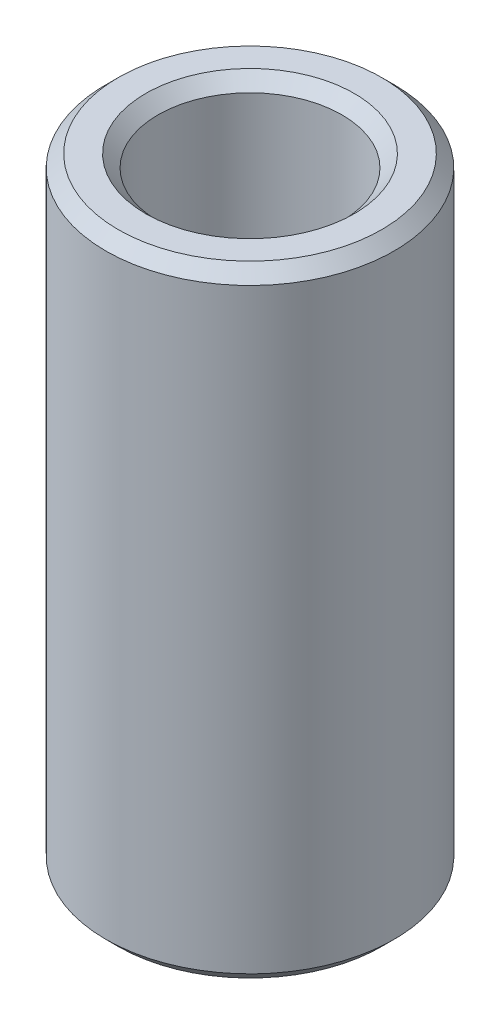
ISO-10303-21;
HEADER;
FILE_DESCRIPTION(('STEP AP214'),'2;1');
FILE_NAME('part.step','',(''),(''),'','','');
FILE_SCHEMA(('AUTOMOTIVE_DESIGN { 1 0 10303 214 1 1 1 1 }'));
ENDSEC;
DATA;
#1=APPLICATION_CONTEXT('core data for automotive mechanical design processes');
#2=APPLICATION_PROTOCOL_DEFINITION('international standard','automotive_design',2000,#1);
#3=PRODUCT_CONTEXT('',#1,'mechanical');
#4=PRODUCT('Part','Part','',(#3));
#5=PRODUCT_RELATED_PRODUCT_CATEGORY('part','',(#4));
#6=PRODUCT_DEFINITION_FORMATION('','',#4);
#7=PRODUCT_DEFINITION_CONTEXT('part definition',#1,'design');
#8=PRODUCT_DEFINITION('design','',#6,#7);
#9=PRODUCT_DEFINITION_SHAPE('','',#8);
#10=(LENGTH_UNIT() NAMED_UNIT(*) SI_UNIT(.MILLI.,.METRE.));
#11=(NAMED_UNIT(*) PLANE_ANGLE_UNIT() SI_UNIT($,.RADIAN.));
#12=(NAMED_UNIT(*) SI_UNIT($,.STERADIAN.) SOLID_ANGLE_UNIT());
#13=UNCERTAINTY_MEASURE_WITH_UNIT(LENGTH_MEASURE(1.E-05),#10,'distance_accuracy_value','');
#14=(GEOMETRIC_REPRESENTATION_CONTEXT(3) GLOBAL_UNCERTAINTY_ASSIGNED_CONTEXT((#13)) GLOBAL_UNIT_ASSIGNED_CONTEXT((#10,
#11,#12)) REPRESENTATION_CONTEXT('',''));
#15=CARTESIAN_POINT('',(0.,0.,0.));
#16=DIRECTION('',(0.,0.,1.));
#17=DIRECTION('',(1.,0.,0.));
#18=AXIS2_PLACEMENT_3D('',#15,#16,#17);
#19=CARTESIAN_POINT('',(0.,129.245161771024,0.));
#20=DIRECTION('',(0.,-1.,0.));
#21=DIRECTION('',(0.,0.,-1.));
#22=AXIS2_PLACEMENT_3D('',#19,#20,#21);
#23=CYLINDRICAL_SURFACE('',#22,30.);
#24=CARTESIAN_POINT('',(0.,2.56942213493205,0.));
#25=DIRECTION('',(0.,1.,0.));
#26=DIRECTION('',(0.,0.,1.));
#27=AXIS2_PLACEMENT_3D('',#24,#25,#26);
#28=CIRCLE('',#27,30.);
#29=CARTESIAN_POINT('',(0.,2.56942213493205,30.));
#30=VERTEX_POINT('',#29);
#31=EDGE_CURVE('E10',#30,#30,#28,.T.);
#32=ORIENTED_EDGE('',*,*,#31,.T.);
#33=EDGE_LOOP('',(#32));
#34=FACE_BOUND('',#33,.T.);
#35=CARTESIAN_POINT('',(0.,126.675739636092,0.));
#36=DIRECTION('',(0.,1.,0.));
#37=DIRECTION('',(0.,0.,1.));
#38=AXIS2_PLACEMENT_3D('',#35,#36,#37);
#39=CIRCLE('',#38,30.);
#40=CARTESIAN_POINT('',(0.,126.675739636092,30.));
#41=VERTEX_POINT('',#40);
#42=EDGE_CURVE('E50',#41,#41,#39,.F.);
#43=ORIENTED_EDGE('',*,*,#42,.T.);
#44=EDGE_LOOP('',(#43));
#45=FACE_BOUND('',#44,.T.);
#46=ADVANCED_FACE('F39',(#34,#45),#23,.T.);
#47=CARTESIAN_POINT('',(0.,129.245161771024,0.));
#48=DIRECTION('',(0.,1.,0.));
#49=DIRECTION('',(0.,0.,1.));
#50=AXIS2_PLACEMENT_3D('',#47,#48,#49);
#51=PLANE('',#50);
#52=CARTESIAN_POINT('',(0.,129.245161771024,0.));
#53=DIRECTION('',(0.,1.,0.));
#54=DIRECTION('',(0.,0.,1.));
#55=AXIS2_PLACEMENT_3D('',#52,#53,#54);
#56=CIRCLE('',#55,21.7052561448556);
#57=CARTESIAN_POINT('',(0.,129.245161771024,21.7052561448556));
#58=VERTEX_POINT('',#57);
#59=EDGE_CURVE('E58',#58,#58,#56,.F.);
#60=ORIENTED_EDGE('',*,*,#59,.T.);
#61=EDGE_LOOP('',(#60));
#62=FACE_BOUND('',#61,.T.);
#63=CARTESIAN_POINT('',(0.,129.245161771024,0.));
#64=DIRECTION('',(0.,1.,0.));
#65=DIRECTION('',(0.,0.,1.));
#66=AXIS2_PLACEMENT_3D('',#63,#64,#65);
#67=CIRCLE('',#66,27.430577865068);
#68=CARTESIAN_POINT('',(0.,129.245161771024,27.430577865068));
#69=VERTEX_POINT('',#68);
#70=EDGE_CURVE('E61',#69,#69,#67,.T.);
#71=ORIENTED_EDGE('',*,*,#70,.T.);
#72=EDGE_LOOP('',(#71));
#73=FACE_BOUND('',#72,.T.);
#74=ADVANCED_FACE('F88',(#62,#73),#51,.T.);
#75=CARTESIAN_POINT('',(0.,0.,0.));
#76=DIRECTION('',(0.,1.,0.));
#77=DIRECTION('',(0.,0.,1.));
#78=AXIS2_PLACEMENT_3D('',#75,#76,#77);
#79=PLANE('',#78);
#80=CARTESIAN_POINT('',(0.,0.,0.));
#81=DIRECTION('',(0.,1.,0.));
#82=DIRECTION('',(0.,0.,1.));
#83=AXIS2_PLACEMENT_3D('',#80,#81,#82);
#84=CIRCLE('',#83,21.7052561448556);
#85=CARTESIAN_POINT('',(0.,0.,21.7052561448556));
#86=VERTEX_POINT('',#85);
#87=EDGE_CURVE('E51',#86,#86,#84,.T.);
#88=ORIENTED_EDGE('',*,*,#87,.T.);
#89=EDGE_LOOP('',(#88));
#90=FACE_BOUND('',#89,.T.);
#91=CARTESIAN_POINT('',(0.,0.,0.));
#92=DIRECTION('',(0.,1.,0.));
#93=DIRECTION('',(0.,0.,1.));
#94=AXIS2_PLACEMENT_3D('',#91,#92,#93);
#95=CIRCLE('',#94,27.4305778650679);
#96=CARTESIAN_POINT('',(0.,0.,27.4305778650679));
#97=VERTEX_POINT('',#96);
#98=EDGE_CURVE('E54',#97,#97,#95,.F.);
#99=ORIENTED_EDGE('',*,*,#98,.T.);
#100=EDGE_LOOP('',(#99));
#101=FACE_BOUND('',#100,.T.);
#102=ADVANCED_FACE('F83',(#90,#101),#79,.F.);
#103=CARTESIAN_POINT('',(0.,129.245161771024,0.));
#104=DIRECTION('',(0.,-1.,0.));
#105=DIRECTION('',(0.,0.,-1.));
#106=AXIS2_PLACEMENT_3D('',#103,#104,#105);
#107=CYLINDRICAL_SURFACE('',#106,19.1358340099236);
#108=CARTESIAN_POINT('',(0.,126.675739636092,0.));
#109=DIRECTION('',(0.,1.,0.));
#110=DIRECTION('',(0.,0.,1.));
#111=AXIS2_PLACEMENT_3D('',#108,#109,#110);
#112=CIRCLE('',#111,19.1358340099236);
#113=CARTESIAN_POINT('',(0.,126.675739636092,19.1358340099236));
#114=VERTEX_POINT('',#113);
#115=EDGE_CURVE('E67',#114,#114,#112,.T.);
#116=ORIENTED_EDGE('',*,*,#115,.T.);
#117=EDGE_LOOP('',(#116));
#118=FACE_BOUND('',#117,.T.);
#119=CARTESIAN_POINT('',(0.,2.56942213493205,0.));
#120=DIRECTION('',(0.,1.,0.));
#121=DIRECTION('',(0.,0.,1.));
#122=AXIS2_PLACEMENT_3D('',#119,#120,#121);
#123=CIRCLE('',#122,19.1358340099236);
#124=CARTESIAN_POINT('',(0.,2.56942213493205,19.1358340099236));
#125=VERTEX_POINT('',#124);
#126=EDGE_CURVE('E69',#125,#125,#123,.F.);
#127=ORIENTED_EDGE('',*,*,#126,.T.);
#128=EDGE_LOOP('',(#127));
#129=FACE_BOUND('',#128,.T.);
#130=ADVANCED_FACE('F71',(#118,#129),#107,.F.);
#131=CARTESIAN_POINT('',(0.,126.675739636092,0.));
#132=DIRECTION('',(0.,1.,0.));
#133=DIRECTION('',(0.,0.,1.));
#134=AXIS2_PLACEMENT_3D('',#131,#132,#133);
#135=CONICAL_SURFACE('',#134,19.1358340099236,0.785398163397448);
#136=ORIENTED_EDGE('',*,*,#59,.F.);
#137=EDGE_LOOP('',(#136));
#138=FACE_BOUND('',#137,.T.);
#139=ORIENTED_EDGE('',*,*,#115,.F.);
#140=EDGE_LOOP('',(#139));
#141=FACE_BOUND('',#140,.T.);
#142=ADVANCED_FACE('F77',(#138,#141),#135,.F.);
#143=CARTESIAN_POINT('',(0.,0.,0.));
#144=DIRECTION('',(0.,-1.,0.));
#145=DIRECTION('',(0.,0.,-1.));
#146=AXIS2_PLACEMENT_3D('',#143,#144,#145);
#147=CONICAL_SURFACE('',#146,21.7052561448556,0.785398163397446);
#148=ORIENTED_EDGE('',*,*,#126,.F.);
#149=EDGE_LOOP('',(#148));
#150=FACE_BOUND('',#149,.T.);
#151=ORIENTED_EDGE('',*,*,#87,.F.);
#152=EDGE_LOOP('',(#151));
#153=FACE_BOUND('',#152,.T.);
#154=ADVANCED_FACE('F73',(#150,#153),#147,.F.);
#155=CARTESIAN_POINT('',(0.,2.56942213493205,0.));
#156=DIRECTION('',(0.,1.,0.));
#157=DIRECTION('',(0.,0.,1.));
#158=AXIS2_PLACEMENT_3D('',#155,#156,#157);
#159=CONICAL_SURFACE('',#158,30.,0.785398163397451);
#160=ORIENTED_EDGE('',*,*,#98,.F.);
#161=EDGE_LOOP('',(#160));
#162=FACE_BOUND('',#161,.T.);
#163=ORIENTED_EDGE('',*,*,#31,.F.);
#164=EDGE_LOOP('',(#163));
#165=FACE_BOUND('',#164,.T.);
#166=ADVANCED_FACE('F76',(#162,#165),#159,.T.);
#167=CARTESIAN_POINT('',(0.,129.245161771024,0.));
#168=DIRECTION('',(0.,-1.,0.));
#169=DIRECTION('',(0.,0.,-1.));
#170=AXIS2_PLACEMENT_3D('',#167,#168,#169);
#171=CONICAL_SURFACE('',#170,27.430577865068,0.785398163397443);
#172=ORIENTED_EDGE('',*,*,#42,.F.);
#173=EDGE_LOOP('',(#172));
#174=FACE_BOUND('',#173,.T.);
#175=ORIENTED_EDGE('',*,*,#70,.F.);
#176=EDGE_LOOP('',(#175));
#177=FACE_BOUND('',#176,.T.);
#178=ADVANCED_FACE('F45',(#174,#177),#171,.T.);
#179=CLOSED_SHELL('',(#46,#74,#102,#130,#142,#154,#166,#178));
#180=MANIFOLD_SOLID_BREP('B2',#179);
#181=ADVANCED_BREP_SHAPE_REPRESENTATION('',(#18,#180),#14);
#182=SHAPE_DEFINITION_REPRESENTATION(#9,#181);
ENDSEC;
END-ISO-10303-21;
